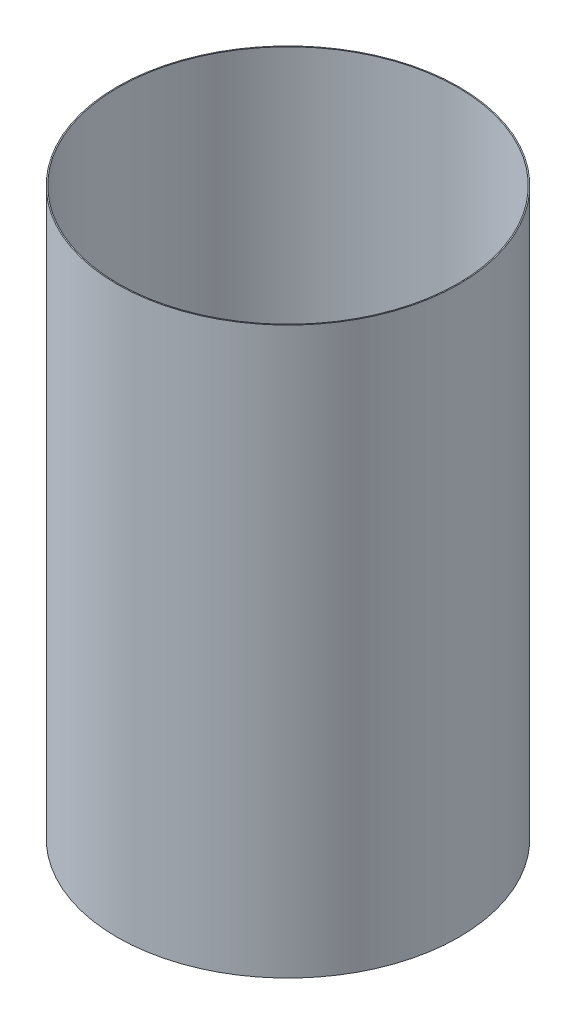
ISO-10303-21;
HEADER;
FILE_DESCRIPTION(('STEP AP214'),'2;1');
FILE_NAME('part.step','',(''),(''),'','','');
FILE_SCHEMA(('AUTOMOTIVE_DESIGN { 1 0 10303 214 1 1 1 1 }'));
ENDSEC;
DATA;
#1=APPLICATION_CONTEXT('core data for automotive mechanical design processes');
#2=APPLICATION_PROTOCOL_DEFINITION('international standard','automotive_design',2000,#1);
#3=PRODUCT_CONTEXT('',#1,'mechanical');
#4=PRODUCT('Part','Part','',(#3));
#5=PRODUCT_RELATED_PRODUCT_CATEGORY('part','',(#4));
#6=PRODUCT_DEFINITION_FORMATION('','',#4);
#7=PRODUCT_DEFINITION_CONTEXT('part definition',#1,'design');
#8=PRODUCT_DEFINITION('design','',#6,#7);
#9=PRODUCT_DEFINITION_SHAPE('','',#8);
#10=(LENGTH_UNIT() NAMED_UNIT(*) SI_UNIT(.MILLI.,.METRE.));
#11=(NAMED_UNIT(*) PLANE_ANGLE_UNIT() SI_UNIT($,.RADIAN.));
#12=(NAMED_UNIT(*) SI_UNIT($,.STERADIAN.) SOLID_ANGLE_UNIT());
#13=UNCERTAINTY_MEASURE_WITH_UNIT(LENGTH_MEASURE(1.E-05),#10,'distance_accuracy_value','');
#14=(GEOMETRIC_REPRESENTATION_CONTEXT(3) GLOBAL_UNCERTAINTY_ASSIGNED_CONTEXT((#13)) GLOBAL_UNIT_ASSIGNED_CONTEXT((#10,
#11,#12)) REPRESENTATION_CONTEXT('',''));
#15=CARTESIAN_POINT('',(0.,0.,0.));
#16=DIRECTION('',(0.,0.,1.));
#17=DIRECTION('',(1.,0.,0.));
#18=AXIS2_PLACEMENT_3D('',#15,#16,#17);
#19=CARTESIAN_POINT('',(0.,55.,0.));
#20=DIRECTION('',(0.,1.,0.));
#21=DIRECTION('',(0.,0.,1.));
#22=AXIS2_PLACEMENT_3D('',#19,#20,#21);
#23=CYLINDRICAL_SURFACE('',#22,40.3225);
#24=CARTESIAN_POINT('',(0.,-202.353193409573,0.));
#25=DIRECTION('',(0.,1.,0.));
#26=DIRECTION('',(0.,0.,1.));
#27=AXIS2_PLACEMENT_3D('',#24,#25,#26);
#28=CIRCLE('',#27,40.3225);
#29=CARTESIAN_POINT('',(0.,-202.353193409573,40.3225));
#30=VERTEX_POINT('',#29);
#31=EDGE_CURVE('E44',#30,#30,#28,.T.);
#32=ORIENTED_EDGE('',*,*,#31,.T.);
#33=EDGE_LOOP('',(#32));
#34=FACE_BOUND('',#33,.T.);
#35=CARTESIAN_POINT('',(0.,-69.0031934095732,0.));
#36=DIRECTION('',(0.,1.,0.));
#37=DIRECTION('',(0.,0.,1.));
#38=AXIS2_PLACEMENT_3D('',#35,#36,#37);
#39=CIRCLE('',#38,40.3225);
#40=CARTESIAN_POINT('',(0.,-69.0031934095732,40.3225));
#41=VERTEX_POINT('',#40);
#42=EDGE_CURVE('E10',#41,#41,#39,.T.);
#43=ORIENTED_EDGE('',*,*,#42,.F.);
#44=EDGE_LOOP('',(#43));
#45=FACE_BOUND('',#44,.T.);
#46=ADVANCED_FACE('F30',(#34,#45),#23,.T.);
#47=CARTESIAN_POINT('',(-40.3225,-69.0031934095732,0.));
#48=DIRECTION('',(0.,-1.,0.));
#49=DIRECTION('',(0.,0.,-1.));
#50=AXIS2_PLACEMENT_3D('',#47,#48,#49);
#51=PLANE('',#50);
#52=CARTESIAN_POINT('',(0.,-69.0031934095732,0.));
#53=DIRECTION('',(0.,1.,0.));
#54=DIRECTION('',(0.,0.,1.));
#55=AXIS2_PLACEMENT_3D('',#52,#53,#54);
#56=CIRCLE('',#55,40.0685);
#57=CARTESIAN_POINT('',(0.,-69.0031934095732,40.0685));
#58=VERTEX_POINT('',#57);
#59=EDGE_CURVE('E36',#58,#58,#56,.T.);
#60=ORIENTED_EDGE('',*,*,#59,.F.);
#61=EDGE_LOOP('',(#60));
#62=FACE_BOUND('',#61,.T.);
#63=ORIENTED_EDGE('',*,*,#42,.T.);
#64=EDGE_LOOP('',(#63));
#65=FACE_BOUND('',#64,.T.);
#66=ADVANCED_FACE('F60',(#62,#65),#51,.F.);
#67=CARTESIAN_POINT('',(0.,55.,0.));
#68=DIRECTION('',(0.,1.,0.));
#69=DIRECTION('',(0.,0.,1.));
#70=AXIS2_PLACEMENT_3D('',#67,#68,#69);
#71=CYLINDRICAL_SURFACE('',#70,40.0685);
#72=CARTESIAN_POINT('',(0.,-202.353193409573,0.));
#73=DIRECTION('',(0.,1.,0.));
#74=DIRECTION('',(0.,0.,1.));
#75=AXIS2_PLACEMENT_3D('',#72,#73,#74);
#76=CIRCLE('',#75,40.0685);
#77=CARTESIAN_POINT('',(0.,-202.353193409573,40.0685));
#78=VERTEX_POINT('',#77);
#79=EDGE_CURVE('E40',#78,#78,#76,.T.);
#80=ORIENTED_EDGE('',*,*,#79,.F.);
#81=EDGE_LOOP('',(#80));
#82=FACE_BOUND('',#81,.T.);
#83=ORIENTED_EDGE('',*,*,#59,.T.);
#84=EDGE_LOOP('',(#83));
#85=FACE_BOUND('',#84,.T.);
#86=ADVANCED_FACE('F55',(#82,#85),#71,.F.);
#87=CARTESIAN_POINT('',(-40.0685,-202.353193409573,0.));
#88=DIRECTION('',(0.,1.,0.));
#89=DIRECTION('',(0.,0.,1.));
#90=AXIS2_PLACEMENT_3D('',#87,#88,#89);
#91=PLANE('',#90);
#92=ORIENTED_EDGE('',*,*,#31,.F.);
#93=EDGE_LOOP('',(#92));
#94=FACE_BOUND('',#93,.T.);
#95=ORIENTED_EDGE('',*,*,#79,.T.);
#96=EDGE_LOOP('',(#95));
#97=FACE_BOUND('',#96,.T.);
#98=ADVANCED_FACE('F52',(#94,#97),#91,.F.);
#99=CLOSED_SHELL('',(#46,#66,#86,#98));
#100=MANIFOLD_SOLID_BREP('B2',#99);
#101=ADVANCED_BREP_SHAPE_REPRESENTATION('',(#18,#100),#14);
#102=SHAPE_DEFINITION_REPRESENTATION(#9,#101);
ENDSEC;
END-ISO-10303-21;
